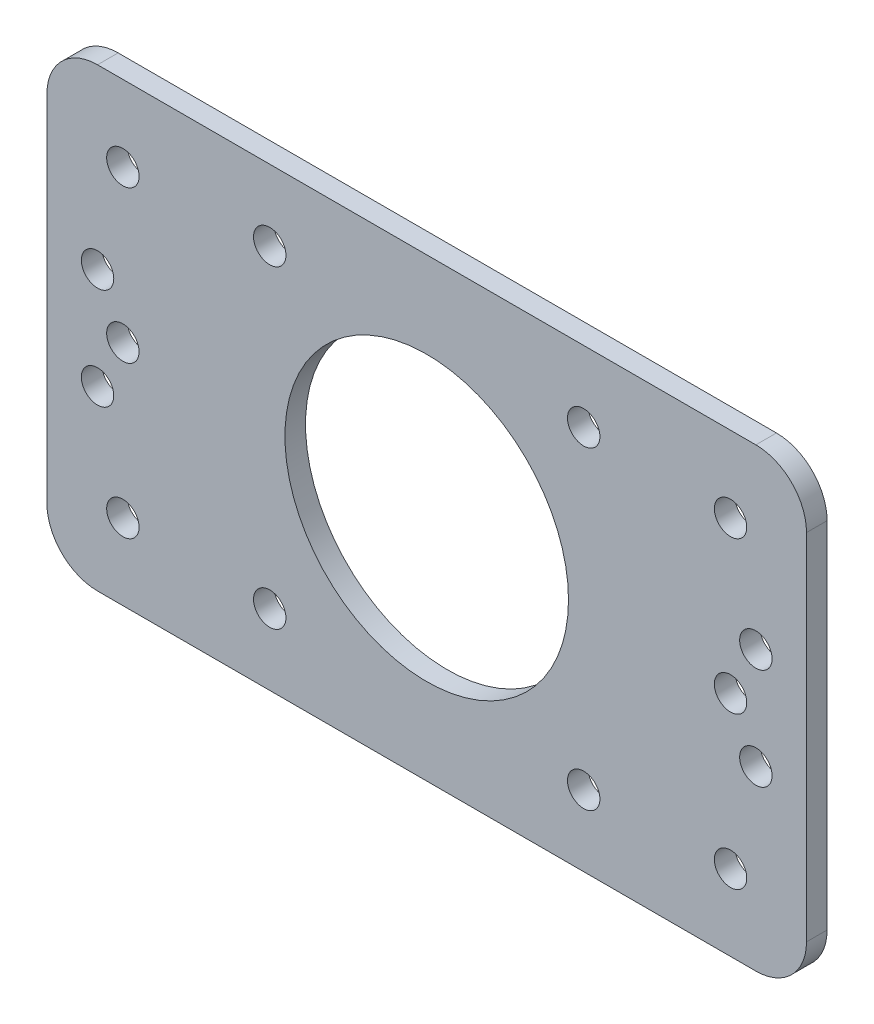
ISO-10303-21;
HEADER;
FILE_DESCRIPTION(('STEP AP214'),'2;1');
FILE_NAME('part.step','',(''),(''),'','','');
FILE_SCHEMA(('AUTOMOTIVE_DESIGN { 1 0 10303 214 1 1 1 1 }'));
ENDSEC;
DATA;
#1=APPLICATION_CONTEXT('core data for automotive mechanical design processes');
#2=APPLICATION_PROTOCOL_DEFINITION('international standard','automotive_design',2000,#1);
#3=PRODUCT_CONTEXT('',#1,'mechanical');
#4=PRODUCT('Part','Part','',(#3));
#5=PRODUCT_RELATED_PRODUCT_CATEGORY('part','',(#4));
#6=PRODUCT_DEFINITION_FORMATION('','',#4);
#7=PRODUCT_DEFINITION_CONTEXT('part definition',#1,'design');
#8=PRODUCT_DEFINITION('design','',#6,#7);
#9=PRODUCT_DEFINITION_SHAPE('','',#8);
#10=(LENGTH_UNIT() NAMED_UNIT(*) SI_UNIT(.MILLI.,.METRE.));
#11=(NAMED_UNIT(*) PLANE_ANGLE_UNIT() SI_UNIT($,.RADIAN.));
#12=(NAMED_UNIT(*) SI_UNIT($,.STERADIAN.) SOLID_ANGLE_UNIT());
#13=UNCERTAINTY_MEASURE_WITH_UNIT(LENGTH_MEASURE(1.E-05),#10,'distance_accuracy_value','');
#14=(GEOMETRIC_REPRESENTATION_CONTEXT(3) GLOBAL_UNCERTAINTY_ASSIGNED_CONTEXT((#13)) GLOBAL_UNIT_ASSIGNED_CONTEXT((#10,
#11,#12)) REPRESENTATION_CONTEXT('',''));
#15=CARTESIAN_POINT('',(0.,0.,0.));
#16=DIRECTION('',(0.,0.,1.));
#17=DIRECTION('',(1.,0.,0.));
#18=AXIS2_PLACEMENT_3D('',#15,#16,#17);
#19=CARTESIAN_POINT('',(0.,0.,2.032));
#20=DIRECTION('',(0.,0.,-1.));
#21=DIRECTION('',(-1.,0.,0.));
#22=AXIS2_PLACEMENT_3D('',#19,#20,#21);
#23=PLANE('',#22);
#24=CARTESIAN_POINT('',(-32.5,5.,2.032));
#25=DIRECTION('',(0.,0.,-1.));
#26=DIRECTION('',(1.,0.,0.));
#27=AXIS2_PLACEMENT_3D('',#24,#25,#26);
#28=CIRCLE('',#27,1.6);
#29=CARTESIAN_POINT('',(-30.9,5.,2.032));
#30=VERTEX_POINT('',#29);
#31=EDGE_CURVE('E312',#30,#30,#28,.T.);
#32=ORIENTED_EDGE('',*,*,#31,.T.);
#33=EDGE_LOOP('',(#32));
#34=FACE_BOUND('',#33,.T.);
#35=CARTESIAN_POINT('',(-32.5,-5.,2.032));
#36=DIRECTION('',(0.,0.,-1.));
#37=DIRECTION('',(-1.,0.,0.));
#38=AXIS2_PLACEMENT_3D('',#35,#36,#37);
#39=CIRCLE('',#38,1.6);
#40=CARTESIAN_POINT('',(-34.1,-5.,2.032));
#41=VERTEX_POINT('',#40);
#42=EDGE_CURVE('E304',#41,#41,#39,.T.);
#43=ORIENTED_EDGE('',*,*,#42,.T.);
#44=EDGE_LOOP('',(#43));
#45=FACE_BOUND('',#44,.T.);
#46=CARTESIAN_POINT('',(32.5,-5.,2.032));
#47=DIRECTION('',(0.,0.,-1.));
#48=DIRECTION('',(1.,0.,0.));
#49=AXIS2_PLACEMENT_3D('',#46,#47,#48);
#50=CIRCLE('',#49,1.6);
#51=CARTESIAN_POINT('',(34.1,-5.,2.032));
#52=VERTEX_POINT('',#51);
#53=EDGE_CURVE('E296',#52,#52,#50,.T.);
#54=ORIENTED_EDGE('',*,*,#53,.T.);
#55=EDGE_LOOP('',(#54));
#56=FACE_BOUND('',#55,.T.);
#57=CARTESIAN_POINT('',(32.5,5.,2.032));
#58=DIRECTION('',(0.,0.,-1.));
#59=DIRECTION('',(-1.,0.,0.));
#60=AXIS2_PLACEMENT_3D('',#57,#58,#59);
#61=CIRCLE('',#60,1.6);
#62=CARTESIAN_POINT('',(30.9,5.,2.032));
#63=VERTEX_POINT('',#62);
#64=EDGE_CURVE('E288',#63,#63,#61,.T.);
#65=ORIENTED_EDGE('',*,*,#64,.T.);
#66=EDGE_LOOP('',(#65));
#67=FACE_BOUND('',#66,.T.);
#68=CARTESIAN_POINT('',(30.,0.,2.032));
#69=DIRECTION('',(0.,0.,1.));
#70=DIRECTION('',(-1.,0.,0.));
#71=AXIS2_PLACEMENT_3D('',#68,#69,#70);
#72=CIRCLE('',#71,1.60000000000001);
#73=CARTESIAN_POINT('',(28.4,0.,2.032));
#74=VERTEX_POINT('',#73);
#75=EDGE_CURVE('E284',#74,#74,#72,.T.);
#76=ORIENTED_EDGE('',*,*,#75,.F.);
#77=EDGE_LOOP('',(#76));
#78=FACE_BOUND('',#77,.T.);
#79=CARTESIAN_POINT('',(30.,15.,2.032));
#80=DIRECTION('',(0.,0.,1.));
#81=DIRECTION('',(-1.,0.,0.));
#82=AXIS2_PLACEMENT_3D('',#79,#80,#81);
#83=CIRCLE('',#82,1.6);
#84=CARTESIAN_POINT('',(28.4,15.,2.032));
#85=VERTEX_POINT('',#84);
#86=EDGE_CURVE('E276',#85,#85,#83,.T.);
#87=ORIENTED_EDGE('',*,*,#86,.F.);
#88=EDGE_LOOP('',(#87));
#89=FACE_BOUND('',#88,.T.);
#90=CARTESIAN_POINT('',(30.,-15.,2.032));
#91=DIRECTION('',(0.,0.,1.));
#92=DIRECTION('',(1.,0.,0.));
#93=AXIS2_PLACEMENT_3D('',#90,#91,#92);
#94=CIRCLE('',#93,1.60000000000001);
#95=CARTESIAN_POINT('',(31.6,-15.,2.032));
#96=VERTEX_POINT('',#95);
#97=EDGE_CURVE('E268',#96,#96,#94,.T.);
#98=ORIENTED_EDGE('',*,*,#97,.F.);
#99=EDGE_LOOP('',(#98));
#100=FACE_BOUND('',#99,.T.);
#101=CARTESIAN_POINT('',(-30.,-15.,2.032));
#102=DIRECTION('',(0.,0.,1.));
#103=DIRECTION('',(-1.,0.,0.));
#104=AXIS2_PLACEMENT_3D('',#101,#102,#103);
#105=CIRCLE('',#104,1.6);
#106=CARTESIAN_POINT('',(-31.6,-15.,2.032));
#107=VERTEX_POINT('',#106);
#108=EDGE_CURVE('E260',#107,#107,#105,.T.);
#109=ORIENTED_EDGE('',*,*,#108,.F.);
#110=EDGE_LOOP('',(#109));
#111=FACE_BOUND('',#110,.T.);
#112=CARTESIAN_POINT('',(-30.,15.,2.032));
#113=DIRECTION('',(0.,0.,1.));
#114=DIRECTION('',(1.,0.,0.));
#115=AXIS2_PLACEMENT_3D('',#112,#113,#114);
#116=CIRCLE('',#115,1.6);
#117=CARTESIAN_POINT('',(-28.4,15.,2.032));
#118=VERTEX_POINT('',#117);
#119=EDGE_CURVE('E252',#118,#118,#116,.T.);
#120=ORIENTED_EDGE('',*,*,#119,.F.);
#121=EDGE_LOOP('',(#120));
#122=FACE_BOUND('',#121,.T.);
#123=CARTESIAN_POINT('',(-30.,0.,2.032));
#124=DIRECTION('',(0.,0.,1.));
#125=DIRECTION('',(1.,0.,0.));
#126=AXIS2_PLACEMENT_3D('',#123,#124,#125);
#127=CIRCLE('',#126,1.60000000000001);
#128=CARTESIAN_POINT('',(-28.4,0.,2.032));
#129=VERTEX_POINT('',#128);
#130=EDGE_CURVE('E244',#129,#129,#127,.T.);
#131=ORIENTED_EDGE('',*,*,#130,.F.);
#132=EDGE_LOOP('',(#131));
#133=FACE_BOUND('',#132,.T.);
#134=CARTESIAN_POINT('',(15.5,-15.5,2.032));
#135=DIRECTION('',(0.,0.,1.));
#136=DIRECTION('',(1.,0.,0.));
#137=AXIS2_PLACEMENT_3D('',#134,#135,#136);
#138=CIRCLE('',#137,1.6);
#139=CARTESIAN_POINT('',(17.1,-15.5,2.032));
#140=VERTEX_POINT('',#139);
#141=EDGE_CURVE('E224',#140,#140,#138,.T.);
#142=ORIENTED_EDGE('',*,*,#141,.F.);
#143=EDGE_LOOP('',(#142));
#144=FACE_BOUND('',#143,.T.);
#145=CARTESIAN_POINT('',(-15.5,15.5,2.032));
#146=DIRECTION('',(0.,0.,1.));
#147=DIRECTION('',(1.,0.,0.));
#148=AXIS2_PLACEMENT_3D('',#145,#146,#147);
#149=CIRCLE('',#148,1.6);
#150=CARTESIAN_POINT('',(-13.9,15.5,2.032));
#151=VERTEX_POINT('',#150);
#152=EDGE_CURVE('E209',#151,#151,#149,.T.);
#153=ORIENTED_EDGE('',*,*,#152,.F.);
#154=EDGE_LOOP('',(#153));
#155=FACE_BOUND('',#154,.T.);
#156=DIRECTION('',(0.,1.,0.));
#157=VECTOR('',#156,1.);
#158=CARTESIAN_POINT('',(37.5,-22.5,2.032));
#159=LINE('',#158,#157);
#160=CARTESIAN_POINT('',(37.5,-17.5,2.032));
#161=VERTEX_POINT('',#160);
#162=CARTESIAN_POINT('',(37.5,17.5,2.032));
#163=VERTEX_POINT('',#162);
#164=EDGE_CURVE('E148',#161,#163,#159,.T.);
#165=ORIENTED_EDGE('',*,*,#164,.T.);
#166=CARTESIAN_POINT('',(32.5,17.5,2.032));
#167=DIRECTION('',(0.,0.,-1.));
#168=DIRECTION('',(-1.,0.,0.));
#169=AXIS2_PLACEMENT_3D('',#166,#167,#168);
#170=CIRCLE('',#169,5.);
#171=CARTESIAN_POINT('',(32.5,22.5,2.032));
#172=VERTEX_POINT('',#171);
#173=EDGE_CURVE('E172',#163,#172,#170,.F.);
#174=ORIENTED_EDGE('',*,*,#173,.T.);
#175=DIRECTION('',(-1.,0.,0.));
#176=VECTOR('',#175,1.);
#177=CARTESIAN_POINT('',(-37.5,22.5,2.032));
#178=LINE('',#177,#176);
#179=CARTESIAN_POINT('',(-32.5,22.5,2.032));
#180=VERTEX_POINT('',#179);
#181=EDGE_CURVE('E124',#172,#180,#178,.T.);
#182=ORIENTED_EDGE('',*,*,#181,.T.);
#183=CARTESIAN_POINT('',(-32.5,17.5,2.032));
#184=DIRECTION('',(0.,0.,-1.));
#185=DIRECTION('',(-1.,0.,0.));
#186=AXIS2_PLACEMENT_3D('',#183,#184,#185);
#187=CIRCLE('',#186,5.);
#188=CARTESIAN_POINT('',(-37.5,17.5,2.032));
#189=VERTEX_POINT('',#188);
#190=EDGE_CURVE('E164',#180,#189,#187,.F.);
#191=ORIENTED_EDGE('',*,*,#190,.T.);
#192=DIRECTION('',(0.,-1.,0.));
#193=VECTOR('',#192,1.);
#194=CARTESIAN_POINT('',(-37.5,-22.5,2.032));
#195=LINE('',#194,#193);
#196=CARTESIAN_POINT('',(-37.5,-17.5,2.032));
#197=VERTEX_POINT('',#196);
#198=EDGE_CURVE('E188',#189,#197,#195,.T.);
#199=ORIENTED_EDGE('',*,*,#198,.T.);
#200=CARTESIAN_POINT('',(-32.5,-17.5,2.032));
#201=DIRECTION('',(0.,0.,-1.));
#202=DIRECTION('',(-1.,0.,0.));
#203=AXIS2_PLACEMENT_3D('',#200,#201,#202);
#204=CIRCLE('',#203,5.);
#205=CARTESIAN_POINT('',(-32.5,-22.5,2.032));
#206=VERTEX_POINT('',#205);
#207=EDGE_CURVE('E59',#197,#206,#204,.F.);
#208=ORIENTED_EDGE('',*,*,#207,.T.);
#209=DIRECTION('',(1.,0.,0.));
#210=VECTOR('',#209,1.);
#211=CARTESIAN_POINT('',(-37.5,-22.5,2.032));
#212=LINE('',#211,#210);
#213=CARTESIAN_POINT('',(32.5,-22.5,2.032));
#214=VERTEX_POINT('',#213);
#215=EDGE_CURVE('E150',#206,#214,#212,.T.);
#216=ORIENTED_EDGE('',*,*,#215,.T.);
#217=CARTESIAN_POINT('',(32.5,-17.5,2.032));
#218=DIRECTION('',(0.,0.,-1.));
#219=DIRECTION('',(-1.,0.,0.));
#220=AXIS2_PLACEMENT_3D('',#217,#218,#219);
#221=CIRCLE('',#220,5.);
#222=EDGE_CURVE('E169',#214,#161,#221,.F.);
#223=ORIENTED_EDGE('',*,*,#222,.T.);
#224=EDGE_LOOP('',(#165,#174,#182,#191,#199,#208,#216,#223));
#225=FACE_BOUND('',#224,.T.);
#226=CARTESIAN_POINT('',(0.,0.,2.032));
#227=DIRECTION('',(0.,0.,1.));
#228=DIRECTION('',(1.,0.,0.));
#229=AXIS2_PLACEMENT_3D('',#226,#227,#228);
#230=CIRCLE('',#229,14.);
#231=CARTESIAN_POINT('',(14.,0.,2.032));
#232=VERTEX_POINT('',#231);
#233=EDGE_CURVE('E142',#232,#232,#230,.T.);
#234=ORIENTED_EDGE('',*,*,#233,.F.);
#235=EDGE_LOOP('',(#234));
#236=FACE_BOUND('',#235,.T.);
#237=CARTESIAN_POINT('',(15.5,15.5,2.032));
#238=DIRECTION('',(0.,0.,1.));
#239=DIRECTION('',(1.,0.,0.));
#240=AXIS2_PLACEMENT_3D('',#237,#238,#239);
#241=CIRCLE('',#240,1.6);
#242=CARTESIAN_POINT('',(17.1,15.5,2.032));
#243=VERTEX_POINT('',#242);
#244=EDGE_CURVE('E216',#243,#243,#241,.T.);
#245=ORIENTED_EDGE('',*,*,#244,.F.);
#246=EDGE_LOOP('',(#245));
#247=FACE_BOUND('',#246,.T.);
#248=CARTESIAN_POINT('',(-15.5,-15.5,2.032));
#249=DIRECTION('',(0.,0.,1.));
#250=DIRECTION('',(1.,0.,0.));
#251=AXIS2_PLACEMENT_3D('',#248,#249,#250);
#252=CIRCLE('',#251,1.6);
#253=CARTESIAN_POINT('',(-13.9,-15.5,2.032));
#254=VERTEX_POINT('',#253);
#255=EDGE_CURVE('E232',#254,#254,#252,.T.);
#256=ORIENTED_EDGE('',*,*,#255,.F.);
#257=EDGE_LOOP('',(#256));
#258=FACE_BOUND('',#257,.T.);
#259=ADVANCED_FACE('F36',(#34,#45,#56,#67,#78,#89,#100,#111,#122,#133,#144,#155,#225,#236,#247,
#258),#23,.F.);
#260=CARTESIAN_POINT('',(0.,0.,0.));
#261=DIRECTION('',(0.,0.,-1.));
#262=DIRECTION('',(-1.,0.,0.));
#263=AXIS2_PLACEMENT_3D('',#260,#261,#262);
#264=PLANE('',#263);
#265=CARTESIAN_POINT('',(-32.5,5.,0.));
#266=DIRECTION('',(0.,0.,-1.));
#267=DIRECTION('',(1.,0.,0.));
#268=AXIS2_PLACEMENT_3D('',#265,#266,#267);
#269=CIRCLE('',#268,1.6);
#270=CARTESIAN_POINT('',(-30.9,5.,0.));
#271=VERTEX_POINT('',#270);
#272=EDGE_CURVE('E316',#271,#271,#269,.T.);
#273=ORIENTED_EDGE('',*,*,#272,.F.);
#274=EDGE_LOOP('',(#273));
#275=FACE_BOUND('',#274,.T.);
#276=CARTESIAN_POINT('',(-32.5,-5.,0.));
#277=DIRECTION('',(0.,0.,-1.));
#278=DIRECTION('',(-1.,0.,0.));
#279=AXIS2_PLACEMENT_3D('',#276,#277,#278);
#280=CIRCLE('',#279,1.6);
#281=CARTESIAN_POINT('',(-34.1,-5.,0.));
#282=VERTEX_POINT('',#281);
#283=EDGE_CURVE('E308',#282,#282,#280,.T.);
#284=ORIENTED_EDGE('',*,*,#283,.F.);
#285=EDGE_LOOP('',(#284));
#286=FACE_BOUND('',#285,.T.);
#287=CARTESIAN_POINT('',(32.5,-5.,0.));
#288=DIRECTION('',(0.,0.,-1.));
#289=DIRECTION('',(1.,0.,0.));
#290=AXIS2_PLACEMENT_3D('',#287,#288,#289);
#291=CIRCLE('',#290,1.6);
#292=CARTESIAN_POINT('',(34.1,-5.,0.));
#293=VERTEX_POINT('',#292);
#294=EDGE_CURVE('E300',#293,#293,#291,.T.);
#295=ORIENTED_EDGE('',*,*,#294,.F.);
#296=EDGE_LOOP('',(#295));
#297=FACE_BOUND('',#296,.T.);
#298=CARTESIAN_POINT('',(32.5,5.,0.));
#299=DIRECTION('',(0.,0.,-1.));
#300=DIRECTION('',(-1.,0.,0.));
#301=AXIS2_PLACEMENT_3D('',#298,#299,#300);
#302=CIRCLE('',#301,1.6);
#303=CARTESIAN_POINT('',(30.9,5.,0.));
#304=VERTEX_POINT('',#303);
#305=EDGE_CURVE('E292',#304,#304,#302,.T.);
#306=ORIENTED_EDGE('',*,*,#305,.F.);
#307=EDGE_LOOP('',(#306));
#308=FACE_BOUND('',#307,.T.);
#309=CARTESIAN_POINT('',(30.,0.,0.));
#310=DIRECTION('',(0.,0.,1.));
#311=DIRECTION('',(-1.,0.,0.));
#312=AXIS2_PLACEMENT_3D('',#309,#310,#311);
#313=CIRCLE('',#312,1.60000000000001);
#314=CARTESIAN_POINT('',(28.4,0.,0.));
#315=VERTEX_POINT('',#314);
#316=EDGE_CURVE('E280',#315,#315,#313,.T.);
#317=ORIENTED_EDGE('',*,*,#316,.T.);
#318=EDGE_LOOP('',(#317));
#319=FACE_BOUND('',#318,.T.);
#320=CARTESIAN_POINT('',(30.,15.,0.));
#321=DIRECTION('',(0.,0.,1.));
#322=DIRECTION('',(-1.,0.,0.));
#323=AXIS2_PLACEMENT_3D('',#320,#321,#322);
#324=CIRCLE('',#323,1.6);
#325=CARTESIAN_POINT('',(28.4,15.,0.));
#326=VERTEX_POINT('',#325);
#327=EDGE_CURVE('E272',#326,#326,#324,.T.);
#328=ORIENTED_EDGE('',*,*,#327,.T.);
#329=EDGE_LOOP('',(#328));
#330=FACE_BOUND('',#329,.T.);
#331=CARTESIAN_POINT('',(30.,-15.,0.));
#332=DIRECTION('',(0.,0.,1.));
#333=DIRECTION('',(1.,0.,0.));
#334=AXIS2_PLACEMENT_3D('',#331,#332,#333);
#335=CIRCLE('',#334,1.60000000000001);
#336=CARTESIAN_POINT('',(31.6,-15.,0.));
#337=VERTEX_POINT('',#336);
#338=EDGE_CURVE('E264',#337,#337,#335,.T.);
#339=ORIENTED_EDGE('',*,*,#338,.T.);
#340=EDGE_LOOP('',(#339));
#341=FACE_BOUND('',#340,.T.);
#342=CARTESIAN_POINT('',(-30.,-15.,0.));
#343=DIRECTION('',(0.,0.,1.));
#344=DIRECTION('',(-1.,0.,0.));
#345=AXIS2_PLACEMENT_3D('',#342,#343,#344);
#346=CIRCLE('',#345,1.6);
#347=CARTESIAN_POINT('',(-31.6,-15.,0.));
#348=VERTEX_POINT('',#347);
#349=EDGE_CURVE('E256',#348,#348,#346,.T.);
#350=ORIENTED_EDGE('',*,*,#349,.T.);
#351=EDGE_LOOP('',(#350));
#352=FACE_BOUND('',#351,.T.);
#353=CARTESIAN_POINT('',(-30.,15.,0.));
#354=DIRECTION('',(0.,0.,1.));
#355=DIRECTION('',(1.,0.,0.));
#356=AXIS2_PLACEMENT_3D('',#353,#354,#355);
#357=CIRCLE('',#356,1.6);
#358=CARTESIAN_POINT('',(-28.4,15.,0.));
#359=VERTEX_POINT('',#358);
#360=EDGE_CURVE('E248',#359,#359,#357,.T.);
#361=ORIENTED_EDGE('',*,*,#360,.T.);
#362=EDGE_LOOP('',(#361));
#363=FACE_BOUND('',#362,.T.);
#364=CARTESIAN_POINT('',(-30.,0.,0.));
#365=DIRECTION('',(0.,0.,1.));
#366=DIRECTION('',(1.,0.,0.));
#367=AXIS2_PLACEMENT_3D('',#364,#365,#366);
#368=CIRCLE('',#367,1.60000000000001);
#369=CARTESIAN_POINT('',(-28.4,0.,0.));
#370=VERTEX_POINT('',#369);
#371=EDGE_CURVE('E240',#370,#370,#368,.T.);
#372=ORIENTED_EDGE('',*,*,#371,.T.);
#373=EDGE_LOOP('',(#372));
#374=FACE_BOUND('',#373,.T.);
#375=CARTESIAN_POINT('',(15.5,-15.5,0.));
#376=DIRECTION('',(0.,0.,1.));
#377=DIRECTION('',(1.,0.,0.));
#378=AXIS2_PLACEMENT_3D('',#375,#376,#377);
#379=CIRCLE('',#378,1.6);
#380=CARTESIAN_POINT('',(17.1,-15.5,0.));
#381=VERTEX_POINT('',#380);
#382=EDGE_CURVE('E228',#381,#381,#379,.T.);
#383=ORIENTED_EDGE('',*,*,#382,.T.);
#384=EDGE_LOOP('',(#383));
#385=FACE_BOUND('',#384,.T.);
#386=CARTESIAN_POINT('',(-15.5,15.5,0.));
#387=DIRECTION('',(0.,0.,1.));
#388=DIRECTION('',(1.,0.,0.));
#389=AXIS2_PLACEMENT_3D('',#386,#387,#388);
#390=CIRCLE('',#389,1.6);
#391=CARTESIAN_POINT('',(-13.9,15.5,0.));
#392=VERTEX_POINT('',#391);
#393=EDGE_CURVE('E213',#392,#392,#390,.T.);
#394=ORIENTED_EDGE('',*,*,#393,.T.);
#395=EDGE_LOOP('',(#394));
#396=FACE_BOUND('',#395,.T.);
#397=DIRECTION('',(-1.,0.,0.));
#398=VECTOR('',#397,1.);
#399=CARTESIAN_POINT('',(-37.5,22.5,0.));
#400=LINE('',#399,#398);
#401=CARTESIAN_POINT('',(32.5,22.5,0.));
#402=VERTEX_POINT('',#401);
#403=CARTESIAN_POINT('',(-32.5,22.5,0.));
#404=VERTEX_POINT('',#403);
#405=EDGE_CURVE('E121',#402,#404,#400,.T.);
#406=ORIENTED_EDGE('',*,*,#405,.F.);
#407=CARTESIAN_POINT('',(32.5,17.5,0.));
#408=DIRECTION('',(0.,0.,-1.));
#409=DIRECTION('',(-1.,0.,0.));
#410=AXIS2_PLACEMENT_3D('',#407,#408,#409);
#411=CIRCLE('',#410,5.);
#412=CARTESIAN_POINT('',(37.5,17.5,0.));
#413=VERTEX_POINT('',#412);
#414=EDGE_CURVE('E103',#402,#413,#411,.T.);
#415=ORIENTED_EDGE('',*,*,#414,.T.);
#416=DIRECTION('',(0.,1.,0.));
#417=VECTOR('',#416,1.);
#418=CARTESIAN_POINT('',(37.5,-22.5,0.));
#419=LINE('',#418,#417);
#420=CARTESIAN_POINT('',(37.5,-17.5,0.));
#421=VERTEX_POINT('',#420);
#422=EDGE_CURVE('E134',#421,#413,#419,.T.);
#423=ORIENTED_EDGE('',*,*,#422,.F.);
#424=CARTESIAN_POINT('',(32.5,-17.5,0.));
#425=DIRECTION('',(0.,0.,-1.));
#426=DIRECTION('',(-1.,0.,0.));
#427=AXIS2_PLACEMENT_3D('',#424,#425,#426);
#428=CIRCLE('',#427,5.);
#429=CARTESIAN_POINT('',(32.5,-22.5,0.));
#430=VERTEX_POINT('',#429);
#431=EDGE_CURVE('E115',#421,#430,#428,.T.);
#432=ORIENTED_EDGE('',*,*,#431,.T.);
#433=DIRECTION('',(1.,0.,0.));
#434=VECTOR('',#433,1.);
#435=CARTESIAN_POINT('',(-37.5,-22.5,0.));
#436=LINE('',#435,#434);
#437=CARTESIAN_POINT('',(-32.5,-22.5,0.));
#438=VERTEX_POINT('',#437);
#439=EDGE_CURVE('E139',#438,#430,#436,.T.);
#440=ORIENTED_EDGE('',*,*,#439,.F.);
#441=CARTESIAN_POINT('',(-32.5,-17.5,0.));
#442=DIRECTION('',(0.,0.,-1.));
#443=DIRECTION('',(-1.,0.,0.));
#444=AXIS2_PLACEMENT_3D('',#441,#442,#443);
#445=CIRCLE('',#444,5.);
#446=CARTESIAN_POINT('',(-37.5,-17.5,0.));
#447=VERTEX_POINT('',#446);
#448=EDGE_CURVE('E154',#438,#447,#445,.T.);
#449=ORIENTED_EDGE('',*,*,#448,.T.);
#450=DIRECTION('',(0.,-1.,0.));
#451=VECTOR('',#450,1.);
#452=CARTESIAN_POINT('',(-37.5,-22.5,0.));
#453=LINE('',#452,#451);
#454=CARTESIAN_POINT('',(-37.5,17.5,0.));
#455=VERTEX_POINT('',#454);
#456=EDGE_CURVE('E133',#455,#447,#453,.T.);
#457=ORIENTED_EDGE('',*,*,#456,.F.);
#458=CARTESIAN_POINT('',(-32.5,17.5,0.));
#459=DIRECTION('',(0.,0.,-1.));
#460=DIRECTION('',(-1.,0.,0.));
#461=AXIS2_PLACEMENT_3D('',#458,#459,#460);
#462=CIRCLE('',#461,5.);
#463=EDGE_CURVE('E126',#455,#404,#462,.T.);
#464=ORIENTED_EDGE('',*,*,#463,.T.);
#465=EDGE_LOOP('',(#406,#415,#423,#432,#440,#449,#457,#464));
#466=FACE_BOUND('',#465,.T.);
#467=CARTESIAN_POINT('',(0.,0.,0.));
#468=DIRECTION('',(0.,0.,1.));
#469=DIRECTION('',(1.,0.,0.));
#470=AXIS2_PLACEMENT_3D('',#467,#468,#469);
#471=CIRCLE('',#470,14.);
#472=CARTESIAN_POINT('',(14.,0.,0.));
#473=VERTEX_POINT('',#472);
#474=EDGE_CURVE('E205',#473,#473,#471,.T.);
#475=ORIENTED_EDGE('',*,*,#474,.T.);
#476=EDGE_LOOP('',(#475));
#477=FACE_BOUND('',#476,.T.);
#478=CARTESIAN_POINT('',(15.5,15.5,0.));
#479=DIRECTION('',(0.,0.,1.));
#480=DIRECTION('',(1.,0.,0.));
#481=AXIS2_PLACEMENT_3D('',#478,#479,#480);
#482=CIRCLE('',#481,1.6);
#483=CARTESIAN_POINT('',(17.1,15.5,0.));
#484=VERTEX_POINT('',#483);
#485=EDGE_CURVE('E220',#484,#484,#482,.T.);
#486=ORIENTED_EDGE('',*,*,#485,.T.);
#487=EDGE_LOOP('',(#486));
#488=FACE_BOUND('',#487,.T.);
#489=CARTESIAN_POINT('',(-15.5,-15.5,0.));
#490=DIRECTION('',(0.,0.,1.));
#491=DIRECTION('',(1.,0.,0.));
#492=AXIS2_PLACEMENT_3D('',#489,#490,#491);
#493=CIRCLE('',#492,1.6);
#494=CARTESIAN_POINT('',(-13.9,-15.5,0.));
#495=VERTEX_POINT('',#494);
#496=EDGE_CURVE('E236',#495,#495,#493,.T.);
#497=ORIENTED_EDGE('',*,*,#496,.T.);
#498=EDGE_LOOP('',(#497));
#499=FACE_BOUND('',#498,.T.);
#500=ADVANCED_FACE('F129',(#275,#286,#297,#308,#319,#330,#341,#352,#363,#374,#385,#396,#466,
#477,#488,#499),#264,.T.);
#501=CARTESIAN_POINT('',(37.5,-22.5,2.032));
#502=DIRECTION('',(-1.,0.,0.));
#503=DIRECTION('',(0.,0.,1.));
#504=AXIS2_PLACEMENT_3D('',#501,#502,#503);
#505=PLANE('',#504);
#506=ORIENTED_EDGE('',*,*,#422,.T.);
#507=DIRECTION('',(0.,0.,-1.));
#508=VECTOR('',#507,1.);
#509=CARTESIAN_POINT('',(37.5,17.5,2.032));
#510=LINE('',#509,#508);
#511=EDGE_CURVE('E108',#413,#163,#510,.F.);
#512=ORIENTED_EDGE('',*,*,#511,.T.);
#513=ORIENTED_EDGE('',*,*,#164,.F.);
#514=DIRECTION('',(0.,0.,-1.));
#515=VECTOR('',#514,1.);
#516=CARTESIAN_POINT('',(37.5,-17.5,2.032));
#517=LINE('',#516,#515);
#518=EDGE_CURVE('E114',#161,#421,#517,.T.);
#519=ORIENTED_EDGE('',*,*,#518,.T.);
#520=EDGE_LOOP('',(#506,#512,#513,#519));
#521=FACE_BOUND('',#520,.T.);
#522=ADVANCED_FACE('F335',(#521),#505,.F.);
#523=CARTESIAN_POINT('',(-37.5,22.5,2.032));
#524=DIRECTION('',(0.,-1.,0.));
#525=DIRECTION('',(0.,0.,-1.));
#526=AXIS2_PLACEMENT_3D('',#523,#524,#525);
#527=PLANE('',#526);
#528=ORIENTED_EDGE('',*,*,#181,.F.);
#529=DIRECTION('',(0.,0.,-1.));
#530=VECTOR('',#529,1.);
#531=CARTESIAN_POINT('',(32.5,22.5,2.032));
#532=LINE('',#531,#530);
#533=EDGE_CURVE('E107',#172,#402,#532,.T.);
#534=ORIENTED_EDGE('',*,*,#533,.T.);
#535=ORIENTED_EDGE('',*,*,#405,.T.);
#536=DIRECTION('',(0.,0.,-1.));
#537=VECTOR('',#536,1.);
#538=CARTESIAN_POINT('',(-32.5,22.5,2.032));
#539=LINE('',#538,#537);
#540=EDGE_CURVE('E127',#404,#180,#539,.F.);
#541=ORIENTED_EDGE('',*,*,#540,.T.);
#542=EDGE_LOOP('',(#528,#534,#535,#541));
#543=FACE_BOUND('',#542,.T.);
#544=ADVANCED_FACE('F120',(#543),#527,.F.);
#545=CARTESIAN_POINT('',(-37.5,-22.5,2.032));
#546=DIRECTION('',(1.,0.,0.));
#547=DIRECTION('',(0.,0.,-1.));
#548=AXIS2_PLACEMENT_3D('',#545,#546,#547);
#549=PLANE('',#548);
#550=ORIENTED_EDGE('',*,*,#456,.T.);
#551=DIRECTION('',(0.,0.,-1.));
#552=VECTOR('',#551,1.);
#553=CARTESIAN_POINT('',(-37.5,-17.5,2.032));
#554=LINE('',#553,#552);
#555=EDGE_CURVE('E11',#447,#197,#554,.F.);
#556=ORIENTED_EDGE('',*,*,#555,.T.);
#557=ORIENTED_EDGE('',*,*,#198,.F.);
#558=DIRECTION('',(0.,0.,-1.));
#559=VECTOR('',#558,1.);
#560=CARTESIAN_POINT('',(-37.5,17.5,2.032));
#561=LINE('',#560,#559);
#562=EDGE_CURVE('E45',#189,#455,#561,.T.);
#563=ORIENTED_EDGE('',*,*,#562,.T.);
#564=EDGE_LOOP('',(#550,#556,#557,#563));
#565=FACE_BOUND('',#564,.T.);
#566=ADVANCED_FACE('F186',(#565),#549,.F.);
#567=CARTESIAN_POINT('',(-37.5,-22.5,2.032));
#568=DIRECTION('',(0.,1.,0.));
#569=DIRECTION('',(0.,0.,1.));
#570=AXIS2_PLACEMENT_3D('',#567,#568,#569);
#571=PLANE('',#570);
#572=ORIENTED_EDGE('',*,*,#439,.T.);
#573=DIRECTION('',(0.,0.,-1.));
#574=VECTOR('',#573,1.);
#575=CARTESIAN_POINT('',(32.5,-22.5,2.032));
#576=LINE('',#575,#574);
#577=EDGE_CURVE('E52',#430,#214,#576,.F.);
#578=ORIENTED_EDGE('',*,*,#577,.T.);
#579=ORIENTED_EDGE('',*,*,#215,.F.);
#580=DIRECTION('',(0.,0.,-1.));
#581=VECTOR('',#580,1.);
#582=CARTESIAN_POINT('',(-32.5,-22.5,2.032));
#583=LINE('',#582,#581);
#584=EDGE_CURVE('E175',#206,#438,#583,.T.);
#585=ORIENTED_EDGE('',*,*,#584,.T.);
#586=EDGE_LOOP('',(#572,#578,#579,#585));
#587=FACE_BOUND('',#586,.T.);
#588=ADVANCED_FACE('F195',(#587),#571,.F.);
#589=CARTESIAN_POINT('',(0.,0.,2.032));
#590=DIRECTION('',(0.,0.,-1.));
#591=DIRECTION('',(-1.,0.,0.));
#592=AXIS2_PLACEMENT_3D('',#589,#590,#591);
#593=CYLINDRICAL_SURFACE('',#592,14.);
#594=ORIENTED_EDGE('',*,*,#233,.T.);
#595=EDGE_LOOP('',(#594));
#596=FACE_BOUND('',#595,.T.);
#597=ORIENTED_EDGE('',*,*,#474,.F.);
#598=EDGE_LOOP('',(#597));
#599=FACE_BOUND('',#598,.T.);
#600=ADVANCED_FACE('F362',(#596,#599),#593,.F.);
#601=CARTESIAN_POINT('',(-15.5,15.5,2.032));
#602=DIRECTION('',(0.,0.,-1.));
#603=DIRECTION('',(-1.,0.,0.));
#604=AXIS2_PLACEMENT_3D('',#601,#602,#603);
#605=CYLINDRICAL_SURFACE('',#604,1.6);
#606=ORIENTED_EDGE('',*,*,#152,.T.);
#607=EDGE_LOOP('',(#606));
#608=FACE_BOUND('',#607,.T.);
#609=ORIENTED_EDGE('',*,*,#393,.F.);
#610=EDGE_LOOP('',(#609));
#611=FACE_BOUND('',#610,.T.);
#612=ADVANCED_FACE('F359',(#608,#611),#605,.F.);
#613=CARTESIAN_POINT('',(15.5,15.5,2.032));
#614=DIRECTION('',(0.,0.,-1.));
#615=DIRECTION('',(-1.,0.,0.));
#616=AXIS2_PLACEMENT_3D('',#613,#614,#615);
#617=CYLINDRICAL_SURFACE('',#616,1.6);
#618=ORIENTED_EDGE('',*,*,#244,.T.);
#619=EDGE_LOOP('',(#618));
#620=FACE_BOUND('',#619,.T.);
#621=ORIENTED_EDGE('',*,*,#485,.F.);
#622=EDGE_LOOP('',(#621));
#623=FACE_BOUND('',#622,.T.);
#624=ADVANCED_FACE('F361',(#620,#623),#617,.F.);
#625=CARTESIAN_POINT('',(15.5,-15.5,2.032));
#626=DIRECTION('',(0.,0.,-1.));
#627=DIRECTION('',(-1.,0.,0.));
#628=AXIS2_PLACEMENT_3D('',#625,#626,#627);
#629=CYLINDRICAL_SURFACE('',#628,1.6);
#630=ORIENTED_EDGE('',*,*,#141,.T.);
#631=EDGE_LOOP('',(#630));
#632=FACE_BOUND('',#631,.T.);
#633=ORIENTED_EDGE('',*,*,#382,.F.);
#634=EDGE_LOOP('',(#633));
#635=FACE_BOUND('',#634,.T.);
#636=ADVANCED_FACE('F369',(#632,#635),#629,.F.);
#637=CARTESIAN_POINT('',(-15.5,-15.5,2.032));
#638=DIRECTION('',(0.,0.,-1.));
#639=DIRECTION('',(-1.,0.,0.));
#640=AXIS2_PLACEMENT_3D('',#637,#638,#639);
#641=CYLINDRICAL_SURFACE('',#640,1.6);
#642=ORIENTED_EDGE('',*,*,#255,.T.);
#643=EDGE_LOOP('',(#642));
#644=FACE_BOUND('',#643,.T.);
#645=ORIENTED_EDGE('',*,*,#496,.F.);
#646=EDGE_LOOP('',(#645));
#647=FACE_BOUND('',#646,.T.);
#648=ADVANCED_FACE('F391',(#644,#647),#641,.F.);
#649=CARTESIAN_POINT('',(32.5,17.5,2.032));
#650=DIRECTION('',(0.,0.,-1.));
#651=DIRECTION('',(-1.,0.,0.));
#652=AXIS2_PLACEMENT_3D('',#649,#650,#651);
#653=CYLINDRICAL_SURFACE('',#652,5.);
#654=ORIENTED_EDGE('',*,*,#173,.F.);
#655=ORIENTED_EDGE('',*,*,#511,.F.);
#656=ORIENTED_EDGE('',*,*,#414,.F.);
#657=ORIENTED_EDGE('',*,*,#533,.F.);
#658=EDGE_LOOP('',(#654,#655,#656,#657));
#659=FACE_BOUND('',#658,.T.);
#660=ADVANCED_FACE('F106',(#659),#653,.T.);
#661=CARTESIAN_POINT('',(32.5,-17.5,2.032));
#662=DIRECTION('',(0.,0.,-1.));
#663=DIRECTION('',(-1.,0.,0.));
#664=AXIS2_PLACEMENT_3D('',#661,#662,#663);
#665=CYLINDRICAL_SURFACE('',#664,5.);
#666=ORIENTED_EDGE('',*,*,#222,.F.);
#667=ORIENTED_EDGE('',*,*,#577,.F.);
#668=ORIENTED_EDGE('',*,*,#431,.F.);
#669=ORIENTED_EDGE('',*,*,#518,.F.);
#670=EDGE_LOOP('',(#666,#667,#668,#669));
#671=FACE_BOUND('',#670,.T.);
#672=ADVANCED_FACE('F390',(#671),#665,.T.);
#673=CARTESIAN_POINT('',(-32.5,-17.5,2.032));
#674=DIRECTION('',(0.,0.,-1.));
#675=DIRECTION('',(-1.,0.,0.));
#676=AXIS2_PLACEMENT_3D('',#673,#674,#675);
#677=CYLINDRICAL_SURFACE('',#676,5.);
#678=ORIENTED_EDGE('',*,*,#207,.F.);
#679=ORIENTED_EDGE('',*,*,#555,.F.);
#680=ORIENTED_EDGE('',*,*,#448,.F.);
#681=ORIENTED_EDGE('',*,*,#584,.F.);
#682=EDGE_LOOP('',(#678,#679,#680,#681));
#683=FACE_BOUND('',#682,.T.);
#684=ADVANCED_FACE('F194',(#683),#677,.T.);
#685=CARTESIAN_POINT('',(-32.5,17.5,2.032));
#686=DIRECTION('',(0.,0.,-1.));
#687=DIRECTION('',(-1.,0.,0.));
#688=AXIS2_PLACEMENT_3D('',#685,#686,#687);
#689=CYLINDRICAL_SURFACE('',#688,5.);
#690=ORIENTED_EDGE('',*,*,#190,.F.);
#691=ORIENTED_EDGE('',*,*,#540,.F.);
#692=ORIENTED_EDGE('',*,*,#463,.F.);
#693=ORIENTED_EDGE('',*,*,#562,.F.);
#694=EDGE_LOOP('',(#690,#691,#692,#693));
#695=FACE_BOUND('',#694,.T.);
#696=ADVANCED_FACE('F38',(#695),#689,.T.);
#697=CARTESIAN_POINT('',(-30.,0.,0.));
#698=DIRECTION('',(0.,0.,1.));
#699=DIRECTION('',(1.,0.,0.));
#700=AXIS2_PLACEMENT_3D('',#697,#698,#699);
#701=CYLINDRICAL_SURFACE('',#700,1.60000000000001);
#702=ORIENTED_EDGE('',*,*,#371,.F.);
#703=EDGE_LOOP('',(#702));
#704=FACE_BOUND('',#703,.T.);
#705=ORIENTED_EDGE('',*,*,#130,.T.);
#706=EDGE_LOOP('',(#705));
#707=FACE_BOUND('',#706,.T.);
#708=ADVANCED_FACE('F398',(#704,#707),#701,.F.);
#709=CARTESIAN_POINT('',(-30.,15.,0.));
#710=DIRECTION('',(0.,0.,1.));
#711=DIRECTION('',(1.,0.,0.));
#712=AXIS2_PLACEMENT_3D('',#709,#710,#711);
#713=CYLINDRICAL_SURFACE('',#712,1.6);
#714=ORIENTED_EDGE('',*,*,#360,.F.);
#715=EDGE_LOOP('',(#714));
#716=FACE_BOUND('',#715,.T.);
#717=ORIENTED_EDGE('',*,*,#119,.T.);
#718=EDGE_LOOP('',(#717));
#719=FACE_BOUND('',#718,.T.);
#720=ADVANCED_FACE('F402',(#716,#719),#713,.F.);
#721=CARTESIAN_POINT('',(-30.,-15.,0.));
#722=DIRECTION('',(0.,0.,1.));
#723=DIRECTION('',(1.,0.,0.));
#724=AXIS2_PLACEMENT_3D('',#721,#722,#723);
#725=CYLINDRICAL_SURFACE('',#724,1.6);
#726=ORIENTED_EDGE('',*,*,#349,.F.);
#727=EDGE_LOOP('',(#726));
#728=FACE_BOUND('',#727,.T.);
#729=ORIENTED_EDGE('',*,*,#108,.T.);
#730=EDGE_LOOP('',(#729));
#731=FACE_BOUND('',#730,.T.);
#732=ADVANCED_FACE('F427',(#728,#731),#725,.F.);
#733=CARTESIAN_POINT('',(30.,-15.,0.));
#734=DIRECTION('',(0.,0.,1.));
#735=DIRECTION('',(1.,0.,0.));
#736=AXIS2_PLACEMENT_3D('',#733,#734,#735);
#737=CYLINDRICAL_SURFACE('',#736,1.60000000000001);
#738=ORIENTED_EDGE('',*,*,#338,.F.);
#739=EDGE_LOOP('',(#738));
#740=FACE_BOUND('',#739,.T.);
#741=ORIENTED_EDGE('',*,*,#97,.T.);
#742=EDGE_LOOP('',(#741));
#743=FACE_BOUND('',#742,.T.);
#744=ADVANCED_FACE('F431',(#740,#743),#737,.F.);
#745=CARTESIAN_POINT('',(30.,15.,0.));
#746=DIRECTION('',(0.,0.,1.));
#747=DIRECTION('',(1.,0.,0.));
#748=AXIS2_PLACEMENT_3D('',#745,#746,#747);
#749=CYLINDRICAL_SURFACE('',#748,1.6);
#750=ORIENTED_EDGE('',*,*,#327,.F.);
#751=EDGE_LOOP('',(#750));
#752=FACE_BOUND('',#751,.T.);
#753=ORIENTED_EDGE('',*,*,#86,.T.);
#754=EDGE_LOOP('',(#753));
#755=FACE_BOUND('',#754,.T.);
#756=ADVANCED_FACE('F435',(#752,#755),#749,.F.);
#757=CARTESIAN_POINT('',(30.,0.,0.));
#758=DIRECTION('',(0.,0.,1.));
#759=DIRECTION('',(1.,0.,0.));
#760=AXIS2_PLACEMENT_3D('',#757,#758,#759);
#761=CYLINDRICAL_SURFACE('',#760,1.60000000000001);
#762=ORIENTED_EDGE('',*,*,#316,.F.);
#763=EDGE_LOOP('',(#762));
#764=FACE_BOUND('',#763,.T.);
#765=ORIENTED_EDGE('',*,*,#75,.T.);
#766=EDGE_LOOP('',(#765));
#767=FACE_BOUND('',#766,.T.);
#768=ADVANCED_FACE('F439',(#764,#767),#761,.F.);
#769=CARTESIAN_POINT('',(32.5,5.,2.032));
#770=DIRECTION('',(0.,0.,-1.));
#771=DIRECTION('',(-1.,0.,0.));
#772=AXIS2_PLACEMENT_3D('',#769,#770,#771);
#773=CYLINDRICAL_SURFACE('',#772,1.6);
#774=ORIENTED_EDGE('',*,*,#64,.F.);
#775=EDGE_LOOP('',(#774));
#776=FACE_BOUND('',#775,.T.);
#777=ORIENTED_EDGE('',*,*,#305,.T.);
#778=EDGE_LOOP('',(#777));
#779=FACE_BOUND('',#778,.T.);
#780=ADVANCED_FACE('F443',(#776,#779),#773,.F.);
#781=CARTESIAN_POINT('',(32.5,-5.,2.032));
#782=DIRECTION('',(0.,0.,-1.));
#783=DIRECTION('',(-1.,0.,0.));
#784=AXIS2_PLACEMENT_3D('',#781,#782,#783);
#785=CYLINDRICAL_SURFACE('',#784,1.6);
#786=ORIENTED_EDGE('',*,*,#53,.F.);
#787=EDGE_LOOP('',(#786));
#788=FACE_BOUND('',#787,.T.);
#789=ORIENTED_EDGE('',*,*,#294,.T.);
#790=EDGE_LOOP('',(#789));
#791=FACE_BOUND('',#790,.T.);
#792=ADVANCED_FACE('F447',(#788,#791),#785,.F.);
#793=CARTESIAN_POINT('',(-32.5,-5.,2.032));
#794=DIRECTION('',(0.,0.,-1.));
#795=DIRECTION('',(-1.,0.,0.));
#796=AXIS2_PLACEMENT_3D('',#793,#794,#795);
#797=CYLINDRICAL_SURFACE('',#796,1.6);
#798=ORIENTED_EDGE('',*,*,#42,.F.);
#799=EDGE_LOOP('',(#798));
#800=FACE_BOUND('',#799,.T.);
#801=ORIENTED_EDGE('',*,*,#283,.T.);
#802=EDGE_LOOP('',(#801));
#803=FACE_BOUND('',#802,.T.);
#804=ADVANCED_FACE('F329',(#800,#803),#797,.F.);
#805=CARTESIAN_POINT('',(-32.5,5.,2.032));
#806=DIRECTION('',(0.,0.,-1.));
#807=DIRECTION('',(-1.,0.,0.));
#808=AXIS2_PLACEMENT_3D('',#805,#806,#807);
#809=CYLINDRICAL_SURFACE('',#808,1.6);
#810=ORIENTED_EDGE('',*,*,#31,.F.);
#811=EDGE_LOOP('',(#810));
#812=FACE_BOUND('',#811,.T.);
#813=ORIENTED_EDGE('',*,*,#272,.T.);
#814=EDGE_LOOP('',(#813));
#815=FACE_BOUND('',#814,.T.);
#816=ADVANCED_FACE('F326',(#812,#815),#809,.F.);
#817=CLOSED_SHELL('',(#259,#500,#522,#544,#566,#588,#600,#612,#624,#636,#648,#660,#672,#684,
#696,#708,#720,#732,#744,#756,#768,#780,#792,#804,#816));
#818=MANIFOLD_SOLID_BREP('B2',#817);
#819=ADVANCED_BREP_SHAPE_REPRESENTATION('',(#18,#818),#14);
#820=SHAPE_DEFINITION_REPRESENTATION(#9,#819);
ENDSEC;
END-ISO-10303-21;
